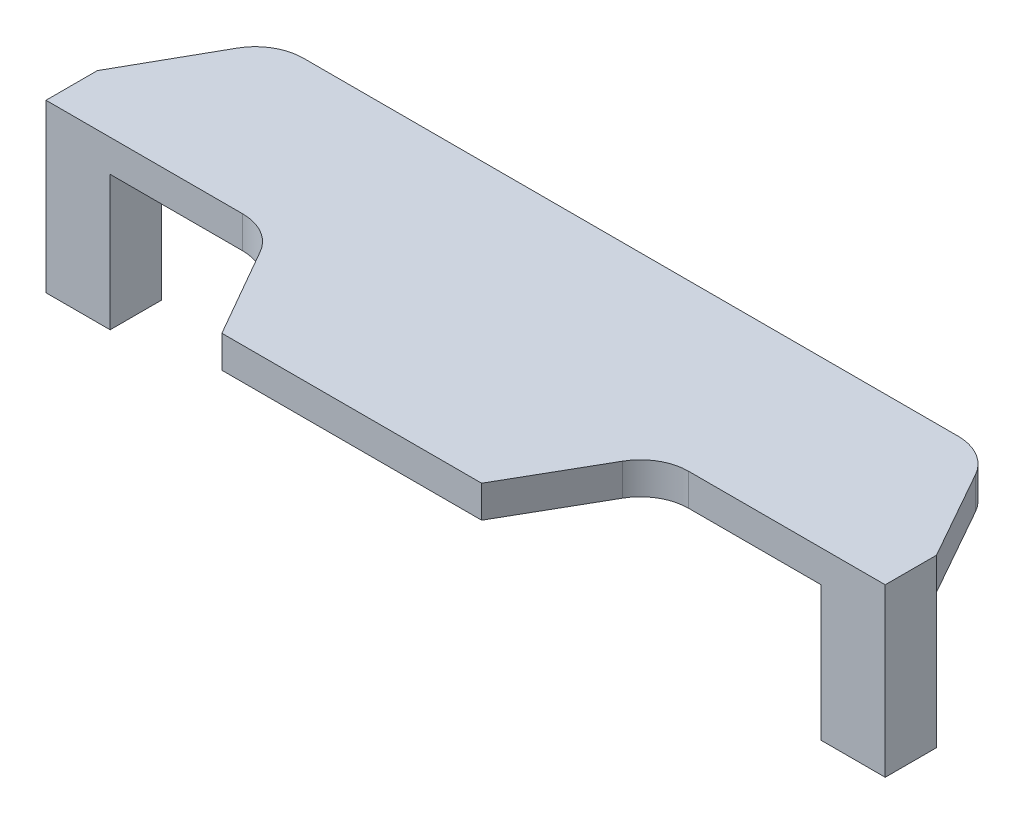
ISO-10303-21;
HEADER;
FILE_DESCRIPTION(('STEP AP214'),'2;1');
FILE_NAME('part.step','',(''),(''),'','','');
FILE_SCHEMA(('AUTOMOTIVE_DESIGN { 1 0 10303 214 1 1 1 1 }'));
ENDSEC;
DATA;
#1=APPLICATION_CONTEXT('core data for automotive mechanical design processes');
#2=APPLICATION_PROTOCOL_DEFINITION('international standard','automotive_design',2000,#1);
#3=PRODUCT_CONTEXT('',#1,'mechanical');
#4=PRODUCT('Part','Part','',(#3));
#5=PRODUCT_RELATED_PRODUCT_CATEGORY('part','',(#4));
#6=PRODUCT_DEFINITION_FORMATION('','',#4);
#7=PRODUCT_DEFINITION_CONTEXT('part definition',#1,'design');
#8=PRODUCT_DEFINITION('design','',#6,#7);
#9=PRODUCT_DEFINITION_SHAPE('','',#8);
#10=(LENGTH_UNIT() NAMED_UNIT(*) SI_UNIT(.MILLI.,.METRE.));
#11=(NAMED_UNIT(*) PLANE_ANGLE_UNIT() SI_UNIT($,.RADIAN.));
#12=(NAMED_UNIT(*) SI_UNIT($,.STERADIAN.) SOLID_ANGLE_UNIT());
#13=UNCERTAINTY_MEASURE_WITH_UNIT(LENGTH_MEASURE(1.E-05),#10,'distance_accuracy_value','');
#14=(GEOMETRIC_REPRESENTATION_CONTEXT(3) GLOBAL_UNCERTAINTY_ASSIGNED_CONTEXT((#13)) GLOBAL_UNIT_ASSIGNED_CONTEXT((#10,
#11,#12)) REPRESENTATION_CONTEXT('',''));
#15=CARTESIAN_POINT('',(0.,0.,0.));
#16=DIRECTION('',(0.,0.,1.));
#17=DIRECTION('',(1.,0.,0.));
#18=AXIS2_PLACEMENT_3D('',#15,#16,#17);
#19=CARTESIAN_POINT('',(51.042007296389,21.,-14.25));
#20=DIRECTION('',(0.,-1.,0.));
#21=DIRECTION('',(0.,0.,-1.));
#22=AXIS2_PLACEMENT_3D('',#19,#20,#21);
#23=PLANE('',#22);
#24=DIRECTION('',(-0.490843733940777,0.,-0.871247627744877));
#25=VECTOR('',#24,1.);
#26=CARTESIAN_POINT('',(65.425,21.,-4.));
#27=LINE('',#26,#25);
#28=CARTESIAN_POINT('',(65.425,21.,-4.));
#29=VERTEX_POINT('',#28);
#30=CARTESIAN_POINT('',(57.5763645044756,21.,-17.9313280045558));
#31=VERTEX_POINT('',#30);
#32=EDGE_CURVE('E151',#29,#31,#27,.T.);
#33=ORIENTED_EDGE('',*,*,#32,.F.);
#34=DIRECTION('',(-1.,0.,0.));
#35=VECTOR('',#34,1.);
#36=CARTESIAN_POINT('',(65.425,21.,-4.));
#37=LINE('',#36,#35);
#38=CARTESIAN_POINT('',(55.425,21.,-4.));
#39=VERTEX_POINT('',#38);
#40=EDGE_CURVE('E321',#29,#39,#37,.T.);
#41=ORIENTED_EDGE('',*,*,#40,.T.);
#42=DIRECTION('',(0.,0.,1.));
#43=VECTOR('',#42,1.);
#44=CARTESIAN_POINT('',(55.425,21.,4.));
#45=LINE('',#44,#43);
#46=CARTESIAN_POINT('',(55.425,21.,4.));
#47=VERTEX_POINT('',#46);
#48=EDGE_CURVE('E329',#39,#47,#45,.T.);
#49=ORIENTED_EDGE('',*,*,#48,.T.);
#50=DIRECTION('',(1.,0.,0.));
#51=VECTOR('',#50,1.);
#52=CARTESIAN_POINT('',(65.425,21.,4.));
#53=LINE('',#52,#51);
#54=CARTESIAN_POINT('',(34.7705838750584,21.,4.));
#55=VERTEX_POINT('',#54);
#56=EDGE_CURVE('E148',#55,#47,#53,.T.);
#57=ORIENTED_EDGE('',*,*,#56,.F.);
#58=CARTESIAN_POINT('',(34.7705838750584,21.,11.5));
#59=DIRECTION('',(0.,-1.,0.));
#60=DIRECTION('',(0.,0.,-1.));
#61=AXIS2_PLACEMENT_3D('',#58,#59,#60);
#62=CIRCLE('',#61,7.5);
#63=CARTESIAN_POINT('',(28.2638420487668,21.,7.77007898126669));
#64=VERTEX_POINT('',#63);
#65=EDGE_CURVE('E145',#64,#55,#62,.T.);
#66=ORIENTED_EDGE('',*,*,#65,.F.);
#67=DIRECTION('',(0.497322802497774,0.,-0.867565576838869));
#68=VECTOR('',#67,1.);
#69=CARTESIAN_POINT('',(28.2638420487668,21.,7.77007898126669));
#70=LINE('',#69,#68);
#71=CARTESIAN_POINT('',(20.25,21.,21.75));
#72=VERTEX_POINT('',#71);
#73=EDGE_CURVE('E142',#72,#64,#70,.T.);
#74=ORIENTED_EDGE('',*,*,#73,.F.);
#75=DIRECTION('',(1.,0.,0.));
#76=VECTOR('',#75,1.);
#77=CARTESIAN_POINT('',(-20.25,21.,21.75));
#78=LINE('',#77,#76);
#79=CARTESIAN_POINT('',(-20.25,21.,21.75));
#80=VERTEX_POINT('',#79);
#81=EDGE_CURVE('E139',#80,#72,#78,.T.);
#82=ORIENTED_EDGE('',*,*,#81,.F.);
#83=DIRECTION('',(0.497322802497775,0.,0.867565576838869));
#84=VECTOR('',#83,1.);
#85=CARTESIAN_POINT('',(-28.2638420487668,21.,7.77007898126669));
#86=LINE('',#85,#84);
#87=CARTESIAN_POINT('',(-28.2638420487668,21.,7.77007898126669));
#88=VERTEX_POINT('',#87);
#89=EDGE_CURVE('E136',#88,#80,#86,.T.);
#90=ORIENTED_EDGE('',*,*,#89,.F.);
#91=CARTESIAN_POINT('',(-34.7705838750584,21.,11.5));
#92=DIRECTION('',(0.,-1.,0.));
#93=DIRECTION('',(0.,0.,1.));
#94=AXIS2_PLACEMENT_3D('',#91,#92,#93);
#95=CIRCLE('',#94,7.5);
#96=CARTESIAN_POINT('',(-34.7705838750584,21.,4.));
#97=VERTEX_POINT('',#96);
#98=EDGE_CURVE('E127',#97,#88,#95,.T.);
#99=ORIENTED_EDGE('',*,*,#98,.F.);
#100=DIRECTION('',(1.,0.,0.));
#101=VECTOR('',#100,1.);
#102=CARTESIAN_POINT('',(-65.425,21.,4.));
#103=LINE('',#102,#101);
#104=CARTESIAN_POINT('',(-55.425,21.,4.));
#105=VERTEX_POINT('',#104);
#106=EDGE_CURVE('E124',#105,#97,#103,.T.);
#107=ORIENTED_EDGE('',*,*,#106,.F.);
#108=DIRECTION('',(0.,0.,-1.));
#109=VECTOR('',#108,1.);
#110=CARTESIAN_POINT('',(-55.425,21.,4.));
#111=LINE('',#110,#109);
#112=CARTESIAN_POINT('',(-55.425,21.,-4.));
#113=VERTEX_POINT('',#112);
#114=EDGE_CURVE('E77',#105,#113,#111,.T.);
#115=ORIENTED_EDGE('',*,*,#114,.T.);
#116=DIRECTION('',(-1.,0.,0.));
#117=VECTOR('',#116,1.);
#118=CARTESIAN_POINT('',(-65.425,21.,-4.));
#119=LINE('',#118,#117);
#120=CARTESIAN_POINT('',(-65.425,21.,-4.));
#121=VERTEX_POINT('',#120);
#122=EDGE_CURVE('E85',#113,#121,#119,.T.);
#123=ORIENTED_EDGE('',*,*,#122,.T.);
#124=DIRECTION('',(-0.490843733940777,0.,0.871247627744877));
#125=VECTOR('',#124,1.);
#126=CARTESIAN_POINT('',(-65.425,21.,-4.));
#127=LINE('',#126,#125);
#128=CARTESIAN_POINT('',(-57.5763645044756,21.,-17.9313280045558));
#129=VERTEX_POINT('',#128);
#130=EDGE_CURVE('E117',#129,#121,#127,.T.);
#131=ORIENTED_EDGE('',*,*,#130,.F.);
#132=CARTESIAN_POINT('',(-51.042007296389,21.,-14.25));
#133=DIRECTION('',(0.,1.,0.));
#134=DIRECTION('',(0.,0.,1.));
#135=AXIS2_PLACEMENT_3D('',#132,#133,#134);
#136=CIRCLE('',#135,7.5);
#137=CARTESIAN_POINT('',(-51.042007296389,21.,-21.75));
#138=VERTEX_POINT('',#137);
#139=EDGE_CURVE('E125',#138,#129,#136,.T.);
#140=ORIENTED_EDGE('',*,*,#139,.F.);
#141=DIRECTION('',(-1.,0.,0.));
#142=VECTOR('',#141,1.);
#143=CARTESIAN_POINT('',(-21.75,21.,-21.75));
#144=LINE('',#143,#142);
#145=CARTESIAN_POINT('',(51.042007296389,21.,-21.75));
#146=VERTEX_POINT('',#145);
#147=EDGE_CURVE('E157',#146,#138,#144,.T.);
#148=ORIENTED_EDGE('',*,*,#147,.F.);
#149=CARTESIAN_POINT('',(51.042007296389,21.,-14.25));
#150=DIRECTION('',(0.,1.,0.));
#151=DIRECTION('',(0.,0.,-1.));
#152=AXIS2_PLACEMENT_3D('',#149,#150,#151);
#153=CIRCLE('',#152,7.5);
#154=EDGE_CURVE('E154',#31,#146,#153,.T.);
#155=ORIENTED_EDGE('',*,*,#154,.F.);
#156=EDGE_LOOP('',(#33,#41,#49,#57,#66,#74,#82,#90,#99,#107,#115,#123,#131,#140,#148,#155));
#157=FACE_BOUND('',#156,.T.);
#158=ADVANCED_FACE('F33',(#157),#23,.T.);
#159=CARTESIAN_POINT('',(-55.425,21.,4.));
#160=DIRECTION('',(-1.,0.,0.));
#161=DIRECTION('',(0.,0.,1.));
#162=AXIS2_PLACEMENT_3D('',#159,#160,#161);
#163=PLANE('',#162);
#164=DIRECTION('',(0.,0.,-1.));
#165=VECTOR('',#164,1.);
#166=CARTESIAN_POINT('',(-55.425,0.,4.));
#167=LINE('',#166,#165);
#168=CARTESIAN_POINT('',(-55.425,0.,4.));
#169=VERTEX_POINT('',#168);
#170=CARTESIAN_POINT('',(-55.425,0.,-4.));
#171=VERTEX_POINT('',#170);
#172=EDGE_CURVE('E82',#169,#171,#167,.T.);
#173=ORIENTED_EDGE('',*,*,#172,.T.);
#174=DIRECTION('',(0.,-1.,0.));
#175=VECTOR('',#174,1.);
#176=CARTESIAN_POINT('',(-55.425,21.,-4.));
#177=LINE('',#176,#175);
#178=EDGE_CURVE('E11',#113,#171,#177,.T.);
#179=ORIENTED_EDGE('',*,*,#178,.F.);
#180=ORIENTED_EDGE('',*,*,#114,.F.);
#181=DIRECTION('',(0.,-1.,0.));
#182=VECTOR('',#181,1.);
#183=CARTESIAN_POINT('',(-55.425,21.,4.));
#184=LINE('',#183,#182);
#185=EDGE_CURVE('E50',#105,#169,#184,.T.);
#186=ORIENTED_EDGE('',*,*,#185,.T.);
#187=EDGE_LOOP('',(#173,#179,#180,#186));
#188=FACE_BOUND('',#187,.T.);
#189=ADVANCED_FACE('F35',(#188),#163,.F.);
#190=CARTESIAN_POINT('',(-65.425,21.,-4.));
#191=DIRECTION('',(0.,0.,1.));
#192=DIRECTION('',(1.,0.,0.));
#193=AXIS2_PLACEMENT_3D('',#190,#191,#192);
#194=PLANE('',#193);
#195=DIRECTION('',(-1.,0.,0.));
#196=VECTOR('',#195,1.);
#197=CARTESIAN_POINT('',(-65.425,0.,-4.));
#198=LINE('',#197,#196);
#199=CARTESIAN_POINT('',(-65.425,0.,-4.));
#200=VERTEX_POINT('',#199);
#201=EDGE_CURVE('E88',#171,#200,#198,.T.);
#202=ORIENTED_EDGE('',*,*,#201,.T.);
#203=DIRECTION('',(0.,-1.,0.));
#204=VECTOR('',#203,1.);
#205=CARTESIAN_POINT('',(-65.425,21.,-4.));
#206=LINE('',#205,#204);
#207=EDGE_CURVE('E42',#121,#200,#206,.T.);
#208=ORIENTED_EDGE('',*,*,#207,.F.);
#209=ORIENTED_EDGE('',*,*,#122,.F.);
#210=ORIENTED_EDGE('',*,*,#178,.T.);
#211=EDGE_LOOP('',(#202,#208,#209,#210));
#212=FACE_BOUND('',#211,.T.);
#213=ADVANCED_FACE('F108',(#212),#194,.F.);
#214=CARTESIAN_POINT('',(-65.425,21.,4.));
#215=DIRECTION('',(1.,0.,0.));
#216=DIRECTION('',(0.,0.,-1.));
#217=AXIS2_PLACEMENT_3D('',#214,#215,#216);
#218=PLANE('',#217);
#219=DIRECTION('',(0.,0.,1.));
#220=VECTOR('',#219,1.);
#221=CARTESIAN_POINT('',(-65.425,0.,4.));
#222=LINE('',#221,#220);
#223=CARTESIAN_POINT('',(-65.425,0.,4.));
#224=VERTEX_POINT('',#223);
#225=EDGE_CURVE('E68',#200,#224,#222,.T.);
#226=ORIENTED_EDGE('',*,*,#225,.T.);
#227=DIRECTION('',(0.,-1.,0.));
#228=VECTOR('',#227,1.);
#229=CARTESIAN_POINT('',(-65.425,21.,4.));
#230=LINE('',#229,#228);
#231=CARTESIAN_POINT('',(-65.425,26.,4.));
#232=VERTEX_POINT('',#231);
#233=EDGE_CURVE('E74',#232,#224,#230,.T.);
#234=ORIENTED_EDGE('',*,*,#233,.F.);
#235=DIRECTION('',(0.,0.,1.));
#236=VECTOR('',#235,1.);
#237=CARTESIAN_POINT('',(-65.425,26.,-4.));
#238=LINE('',#237,#236);
#239=CARTESIAN_POINT('',(-65.425,26.,-4.));
#240=VERTEX_POINT('',#239);
#241=EDGE_CURVE('E397',#240,#232,#238,.T.);
#242=ORIENTED_EDGE('',*,*,#241,.F.);
#243=DIRECTION('',(0.,-1.,0.));
#244=VECTOR('',#243,1.);
#245=CARTESIAN_POINT('',(-65.425,26.,-4.));
#246=LINE('',#245,#244);
#247=EDGE_CURVE('E105',#240,#121,#246,.T.);
#248=ORIENTED_EDGE('',*,*,#247,.T.);
#249=ORIENTED_EDGE('',*,*,#207,.T.);
#250=EDGE_LOOP('',(#226,#234,#242,#248,#249));
#251=FACE_BOUND('',#250,.T.);
#252=ADVANCED_FACE('F101',(#251),#218,.F.);
#253=CARTESIAN_POINT('',(-65.425,21.,4.));
#254=DIRECTION('',(0.,0.,-1.));
#255=DIRECTION('',(-1.,0.,0.));
#256=AXIS2_PLACEMENT_3D('',#253,#254,#255);
#257=PLANE('',#256);
#258=DIRECTION('',(1.,0.,0.));
#259=VECTOR('',#258,1.);
#260=CARTESIAN_POINT('',(-65.425,0.,4.));
#261=LINE('',#260,#259);
#262=EDGE_CURVE('E71',#224,#169,#261,.T.);
#263=ORIENTED_EDGE('',*,*,#262,.T.);
#264=ORIENTED_EDGE('',*,*,#185,.F.);
#265=ORIENTED_EDGE('',*,*,#106,.T.);
#266=DIRECTION('',(0.,-1.,0.));
#267=VECTOR('',#266,1.);
#268=CARTESIAN_POINT('',(-34.7705838750584,26.,4.));
#269=LINE('',#268,#267);
#270=CARTESIAN_POINT('',(-34.7705838750584,26.,4.));
#271=VERTEX_POINT('',#270);
#272=EDGE_CURVE('E189',#271,#97,#269,.T.);
#273=ORIENTED_EDGE('',*,*,#272,.F.);
#274=DIRECTION('',(1.,0.,0.));
#275=VECTOR('',#274,1.);
#276=CARTESIAN_POINT('',(-65.425,26.,4.));
#277=LINE('',#276,#275);
#278=EDGE_CURVE('E400',#232,#271,#277,.T.);
#279=ORIENTED_EDGE('',*,*,#278,.F.);
#280=ORIENTED_EDGE('',*,*,#233,.T.);
#281=EDGE_LOOP('',(#263,#264,#265,#273,#279,#280));
#282=FACE_BOUND('',#281,.T.);
#283=ADVANCED_FACE('F72',(#282),#257,.F.);
#284=CARTESIAN_POINT('',(0.,0.,0.));
#285=DIRECTION('',(0.,-1.,0.));
#286=DIRECTION('',(0.,0.,-1.));
#287=AXIS2_PLACEMENT_3D('',#284,#285,#286);
#288=PLANE('',#287);
#289=ORIENTED_EDGE('',*,*,#172,.F.);
#290=ORIENTED_EDGE('',*,*,#262,.F.);
#291=ORIENTED_EDGE('',*,*,#225,.F.);
#292=ORIENTED_EDGE('',*,*,#201,.F.);
#293=EDGE_LOOP('',(#289,#290,#291,#292));
#294=FACE_BOUND('',#293,.T.);
#295=ADVANCED_FACE('F87',(#294),#288,.T.);
#296=CARTESIAN_POINT('',(-51.042007296389,26.,-14.25));
#297=DIRECTION('',(0.,-1.,0.));
#298=DIRECTION('',(0.,0.,-1.));
#299=AXIS2_PLACEMENT_3D('',#296,#297,#298);
#300=CYLINDRICAL_SURFACE('',#299,7.5);
#301=ORIENTED_EDGE('',*,*,#139,.T.);
#302=DIRECTION('',(0.,-1.,0.));
#303=VECTOR('',#302,1.);
#304=CARTESIAN_POINT('',(-57.5763645044756,26.,-17.9313280045558));
#305=LINE('',#304,#303);
#306=CARTESIAN_POINT('',(-57.5763645044756,26.,-17.9313280045558));
#307=VERTEX_POINT('',#306);
#308=EDGE_CURVE('E93',#307,#129,#305,.T.);
#309=ORIENTED_EDGE('',*,*,#308,.F.);
#310=CARTESIAN_POINT('',(-51.042007296389,26.,-14.25));
#311=DIRECTION('',(0.,1.,0.));
#312=DIRECTION('',(0.,0.,1.));
#313=AXIS2_PLACEMENT_3D('',#310,#311,#312);
#314=CIRCLE('',#313,7.5);
#315=CARTESIAN_POINT('',(-51.042007296389,26.,-21.75));
#316=VERTEX_POINT('',#315);
#317=EDGE_CURVE('E393',#316,#307,#314,.T.);
#318=ORIENTED_EDGE('',*,*,#317,.F.);
#319=DIRECTION('',(0.,-1.,0.));
#320=VECTOR('',#319,1.);
#321=CARTESIAN_POINT('',(-51.042007296389,26.,-21.75));
#322=LINE('',#321,#320);
#323=EDGE_CURVE('E89',#316,#138,#322,.T.);
#324=ORIENTED_EDGE('',*,*,#323,.T.);
#325=EDGE_LOOP('',(#301,#309,#318,#324));
#326=FACE_BOUND('',#325,.T.);
#327=ADVANCED_FACE('F402',(#326),#300,.T.);
#328=CARTESIAN_POINT('',(-65.425,26.,-4.));
#329=DIRECTION('',(0.871247627744877,0.,0.490843733940777));
#330=DIRECTION('',(0.490843733940777,0.,-0.871247627744877));
#331=AXIS2_PLACEMENT_3D('',#328,#329,#330);
#332=PLANE('',#331);
#333=ORIENTED_EDGE('',*,*,#130,.T.);
#334=ORIENTED_EDGE('',*,*,#247,.F.);
#335=DIRECTION('',(-0.490843733940777,0.,0.871247627744877));
#336=VECTOR('',#335,1.);
#337=CARTESIAN_POINT('',(-65.425,26.,-4.));
#338=LINE('',#337,#336);
#339=EDGE_CURVE('E395',#307,#240,#338,.T.);
#340=ORIENTED_EDGE('',*,*,#339,.F.);
#341=ORIENTED_EDGE('',*,*,#308,.T.);
#342=EDGE_LOOP('',(#333,#334,#340,#341));
#343=FACE_BOUND('',#342,.T.);
#344=ADVANCED_FACE('F120',(#343),#332,.F.);
#345=CARTESIAN_POINT('',(-34.7705838750584,26.,11.5));
#346=DIRECTION('',(0.,-1.,0.));
#347=DIRECTION('',(0.,0.,-1.));
#348=AXIS2_PLACEMENT_3D('',#345,#346,#347);
#349=CYLINDRICAL_SURFACE('',#348,7.5);
#350=ORIENTED_EDGE('',*,*,#98,.T.);
#351=DIRECTION('',(0.,-1.,0.));
#352=VECTOR('',#351,1.);
#353=CARTESIAN_POINT('',(-28.2638420487668,26.,7.77007898126669));
#354=LINE('',#353,#352);
#355=CARTESIAN_POINT('',(-28.2638420487668,26.,7.77007898126669));
#356=VERTEX_POINT('',#355);
#357=EDGE_CURVE('E186',#356,#88,#354,.T.);
#358=ORIENTED_EDGE('',*,*,#357,.F.);
#359=CARTESIAN_POINT('',(-34.7705838750584,26.,11.5));
#360=DIRECTION('',(0.,-1.,0.));
#361=DIRECTION('',(0.,0.,1.));
#362=AXIS2_PLACEMENT_3D('',#359,#360,#361);
#363=CIRCLE('',#362,7.5);
#364=EDGE_CURVE('E202',#271,#356,#363,.T.);
#365=ORIENTED_EDGE('',*,*,#364,.F.);
#366=ORIENTED_EDGE('',*,*,#272,.T.);
#367=EDGE_LOOP('',(#350,#358,#365,#366));
#368=FACE_BOUND('',#367,.T.);
#369=ADVANCED_FACE('F197',(#368),#349,.F.);
#370=CARTESIAN_POINT('',(-28.2638420487668,26.,7.77007898126669));
#371=DIRECTION('',(0.867565576838869,0.,-0.497322802497775));
#372=DIRECTION('',(-0.497322802497775,0.,-0.867565576838869));
#373=AXIS2_PLACEMENT_3D('',#370,#371,#372);
#374=PLANE('',#373);
#375=ORIENTED_EDGE('',*,*,#89,.T.);
#376=DIRECTION('',(0.,-1.,0.));
#377=VECTOR('',#376,1.);
#378=CARTESIAN_POINT('',(-20.25,26.,21.75));
#379=LINE('',#378,#377);
#380=CARTESIAN_POINT('',(-20.25,26.,21.75));
#381=VERTEX_POINT('',#380);
#382=EDGE_CURVE('E183',#381,#80,#379,.T.);
#383=ORIENTED_EDGE('',*,*,#382,.F.);
#384=DIRECTION('',(0.497322802497775,0.,0.867565576838869));
#385=VECTOR('',#384,1.);
#386=CARTESIAN_POINT('',(-28.2638420487668,26.,7.77007898126669));
#387=LINE('',#386,#385);
#388=EDGE_CURVE('E230',#356,#381,#387,.T.);
#389=ORIENTED_EDGE('',*,*,#388,.F.);
#390=ORIENTED_EDGE('',*,*,#357,.T.);
#391=EDGE_LOOP('',(#375,#383,#389,#390));
#392=FACE_BOUND('',#391,.T.);
#393=ADVANCED_FACE('F211',(#392),#374,.F.);
#394=CARTESIAN_POINT('',(-20.25,26.,21.75));
#395=DIRECTION('',(0.,0.,-1.));
#396=DIRECTION('',(-1.,0.,0.));
#397=AXIS2_PLACEMENT_3D('',#394,#395,#396);
#398=PLANE('',#397);
#399=ORIENTED_EDGE('',*,*,#81,.T.);
#400=DIRECTION('',(0.,-1.,0.));
#401=VECTOR('',#400,1.);
#402=CARTESIAN_POINT('',(20.25,26.,21.75));
#403=LINE('',#402,#401);
#404=CARTESIAN_POINT('',(20.25,26.,21.75));
#405=VERTEX_POINT('',#404);
#406=EDGE_CURVE('E180',#405,#72,#403,.T.);
#407=ORIENTED_EDGE('',*,*,#406,.F.);
#408=DIRECTION('',(1.,0.,0.));
#409=VECTOR('',#408,1.);
#410=CARTESIAN_POINT('',(-20.25,26.,21.75));
#411=LINE('',#410,#409);
#412=EDGE_CURVE('E221',#381,#405,#411,.T.);
#413=ORIENTED_EDGE('',*,*,#412,.F.);
#414=ORIENTED_EDGE('',*,*,#382,.T.);
#415=EDGE_LOOP('',(#399,#407,#413,#414));
#416=FACE_BOUND('',#415,.T.);
#417=ADVANCED_FACE('F218',(#416),#398,.F.);
#418=CARTESIAN_POINT('',(28.2638420487668,26.,7.77007898126669));
#419=DIRECTION('',(-0.867565576838869,0.,-0.497322802497774));
#420=DIRECTION('',(-0.497322802497774,0.,0.867565576838869));
#421=AXIS2_PLACEMENT_3D('',#418,#419,#420);
#422=PLANE('',#421);
#423=ORIENTED_EDGE('',*,*,#73,.T.);
#424=DIRECTION('',(0.,-1.,0.));
#425=VECTOR('',#424,1.);
#426=CARTESIAN_POINT('',(28.2638420487668,26.,7.77007898126669));
#427=LINE('',#426,#425);
#428=CARTESIAN_POINT('',(28.2638420487668,26.,7.77007898126669));
#429=VERTEX_POINT('',#428);
#430=EDGE_CURVE('E177',#429,#64,#427,.T.);
#431=ORIENTED_EDGE('',*,*,#430,.F.);
#432=DIRECTION('',(0.497322802497774,0.,-0.867565576838869));
#433=VECTOR('',#432,1.);
#434=CARTESIAN_POINT('',(28.2638420487668,26.,7.77007898126669));
#435=LINE('',#434,#433);
#436=EDGE_CURVE('E229',#405,#429,#435,.T.);
#437=ORIENTED_EDGE('',*,*,#436,.F.);
#438=ORIENTED_EDGE('',*,*,#406,.T.);
#439=EDGE_LOOP('',(#423,#431,#437,#438));
#440=FACE_BOUND('',#439,.T.);
#441=ADVANCED_FACE('F487',(#440),#422,.F.);
#442=CARTESIAN_POINT('',(34.7705838750584,26.,11.5));
#443=DIRECTION('',(0.,-1.,0.));
#444=DIRECTION('',(0.,0.,-1.));
#445=AXIS2_PLACEMENT_3D('',#442,#443,#444);
#446=CYLINDRICAL_SURFACE('',#445,7.5);
#447=ORIENTED_EDGE('',*,*,#65,.T.);
#448=DIRECTION('',(0.,-1.,0.));
#449=VECTOR('',#448,1.);
#450=CARTESIAN_POINT('',(34.7705838750584,26.,4.));
#451=LINE('',#450,#449);
#452=CARTESIAN_POINT('',(34.7705838750584,26.,4.));
#453=VERTEX_POINT('',#452);
#454=EDGE_CURVE('E174',#453,#55,#451,.T.);
#455=ORIENTED_EDGE('',*,*,#454,.F.);
#456=CARTESIAN_POINT('',(34.7705838750584,26.,11.5));
#457=DIRECTION('',(0.,-1.,0.));
#458=DIRECTION('',(0.,0.,-1.));
#459=AXIS2_PLACEMENT_3D('',#456,#457,#458);
#460=CIRCLE('',#459,7.5);
#461=EDGE_CURVE('E232',#429,#453,#460,.T.);
#462=ORIENTED_EDGE('',*,*,#461,.F.);
#463=ORIENTED_EDGE('',*,*,#430,.T.);
#464=EDGE_LOOP('',(#447,#455,#462,#463));
#465=FACE_BOUND('',#464,.T.);
#466=ADVANCED_FACE('F495',(#465),#446,.F.);
#467=CARTESIAN_POINT('',(65.425,26.,4.));
#468=DIRECTION('',(0.,0.,-1.));
#469=DIRECTION('',(-1.,0.,0.));
#470=AXIS2_PLACEMENT_3D('',#467,#468,#469);
#471=PLANE('',#470);
#472=ORIENTED_EDGE('',*,*,#56,.T.);
#473=DIRECTION('',(0.,-1.,0.));
#474=VECTOR('',#473,1.);
#475=CARTESIAN_POINT('',(55.425,21.,4.));
#476=LINE('',#475,#474);
#477=CARTESIAN_POINT('',(55.425,0.,4.));
#478=VERTEX_POINT('',#477);
#479=EDGE_CURVE('E388',#47,#478,#476,.T.);
#480=ORIENTED_EDGE('',*,*,#479,.T.);
#481=DIRECTION('',(1.,0.,0.));
#482=VECTOR('',#481,1.);
#483=CARTESIAN_POINT('',(65.425,0.,4.));
#484=LINE('',#483,#482);
#485=CARTESIAN_POINT('',(65.425,0.,4.));
#486=VERTEX_POINT('',#485);
#487=EDGE_CURVE('E330',#478,#486,#484,.T.);
#488=ORIENTED_EDGE('',*,*,#487,.T.);
#489=DIRECTION('',(0.,-1.,0.));
#490=VECTOR('',#489,1.);
#491=CARTESIAN_POINT('',(65.425,26.,4.));
#492=LINE('',#491,#490);
#493=CARTESIAN_POINT('',(65.425,26.,4.));
#494=VERTEX_POINT('',#493);
#495=EDGE_CURVE('E171',#494,#486,#492,.T.);
#496=ORIENTED_EDGE('',*,*,#495,.F.);
#497=DIRECTION('',(1.,0.,0.));
#498=VECTOR('',#497,1.);
#499=CARTESIAN_POINT('',(65.425,26.,4.));
#500=LINE('',#499,#498);
#501=EDGE_CURVE('E239',#453,#494,#500,.T.);
#502=ORIENTED_EDGE('',*,*,#501,.F.);
#503=ORIENTED_EDGE('',*,*,#454,.T.);
#504=EDGE_LOOP('',(#472,#480,#488,#496,#502,#503));
#505=FACE_BOUND('',#504,.T.);
#506=ADVANCED_FACE('F348',(#505),#471,.F.);
#507=CARTESIAN_POINT('',(65.425,26.,-4.));
#508=DIRECTION('',(-1.,0.,0.));
#509=DIRECTION('',(0.,0.,1.));
#510=AXIS2_PLACEMENT_3D('',#507,#508,#509);
#511=PLANE('',#510);
#512=ORIENTED_EDGE('',*,*,#495,.T.);
#513=DIRECTION('',(0.,0.,-1.));
#514=VECTOR('',#513,1.);
#515=CARTESIAN_POINT('',(65.425,0.,4.));
#516=LINE('',#515,#514);
#517=CARTESIAN_POINT('',(65.425,0.,-4.));
#518=VERTEX_POINT('',#517);
#519=EDGE_CURVE('E337',#486,#518,#516,.T.);
#520=ORIENTED_EDGE('',*,*,#519,.T.);
#521=DIRECTION('',(0.,-1.,0.));
#522=VECTOR('',#521,1.);
#523=CARTESIAN_POINT('',(65.425,21.,-4.));
#524=LINE('',#523,#522);
#525=EDGE_CURVE('E130',#29,#518,#524,.T.);
#526=ORIENTED_EDGE('',*,*,#525,.F.);
#527=DIRECTION('',(0.,-1.,0.));
#528=VECTOR('',#527,1.);
#529=CARTESIAN_POINT('',(65.425,26.,-4.));
#530=LINE('',#529,#528);
#531=CARTESIAN_POINT('',(65.425,26.,-4.));
#532=VERTEX_POINT('',#531);
#533=EDGE_CURVE('E168',#532,#29,#530,.T.);
#534=ORIENTED_EDGE('',*,*,#533,.F.);
#535=DIRECTION('',(0.,0.,-1.));
#536=VECTOR('',#535,1.);
#537=CARTESIAN_POINT('',(65.425,26.,-4.));
#538=LINE('',#537,#536);
#539=EDGE_CURVE('E242',#494,#532,#538,.T.);
#540=ORIENTED_EDGE('',*,*,#539,.F.);
#541=EDGE_LOOP('',(#512,#520,#526,#534,#540));
#542=FACE_BOUND('',#541,.T.);
#543=ADVANCED_FACE('F334',(#542),#511,.F.);
#544=CARTESIAN_POINT('',(65.425,26.,-4.));
#545=DIRECTION('',(-0.871247627744877,0.,0.490843733940777));
#546=DIRECTION('',(0.490843733940777,0.,0.871247627744877));
#547=AXIS2_PLACEMENT_3D('',#544,#545,#546);
#548=PLANE('',#547);
#549=ORIENTED_EDGE('',*,*,#32,.T.);
#550=DIRECTION('',(0.,-1.,0.));
#551=VECTOR('',#550,1.);
#552=CARTESIAN_POINT('',(57.5763645044756,26.,-17.9313280045558));
#553=LINE('',#552,#551);
#554=CARTESIAN_POINT('',(57.5763645044756,26.,-17.9313280045558));
#555=VERTEX_POINT('',#554);
#556=EDGE_CURVE('E164',#555,#31,#553,.T.);
#557=ORIENTED_EDGE('',*,*,#556,.F.);
#558=DIRECTION('',(-0.490843733940777,0.,-0.871247627744877));
#559=VECTOR('',#558,1.);
#560=CARTESIAN_POINT('',(65.425,26.,-4.));
#561=LINE('',#560,#559);
#562=EDGE_CURVE('E245',#532,#555,#561,.T.);
#563=ORIENTED_EDGE('',*,*,#562,.F.);
#564=ORIENTED_EDGE('',*,*,#533,.T.);
#565=EDGE_LOOP('',(#549,#557,#563,#564));
#566=FACE_BOUND('',#565,.T.);
#567=ADVANCED_FACE('F340',(#566),#548,.F.);
#568=CARTESIAN_POINT('',(51.042007296389,26.,-14.25));
#569=DIRECTION('',(0.,-1.,0.));
#570=DIRECTION('',(0.,0.,-1.));
#571=AXIS2_PLACEMENT_3D('',#568,#569,#570);
#572=CYLINDRICAL_SURFACE('',#571,7.5);
#573=ORIENTED_EDGE('',*,*,#154,.T.);
#574=DIRECTION('',(0.,-1.,0.));
#575=VECTOR('',#574,1.);
#576=CARTESIAN_POINT('',(51.042007296389,26.,-21.75));
#577=LINE('',#576,#575);
#578=CARTESIAN_POINT('',(51.042007296389,26.,-21.75));
#579=VERTEX_POINT('',#578);
#580=EDGE_CURVE('E161',#579,#146,#577,.T.);
#581=ORIENTED_EDGE('',*,*,#580,.F.);
#582=CARTESIAN_POINT('',(51.042007296389,26.,-14.25));
#583=DIRECTION('',(0.,1.,0.));
#584=DIRECTION('',(0.,0.,-1.));
#585=AXIS2_PLACEMENT_3D('',#582,#583,#584);
#586=CIRCLE('',#585,7.5);
#587=EDGE_CURVE('E165',#555,#579,#586,.T.);
#588=ORIENTED_EDGE('',*,*,#587,.F.);
#589=ORIENTED_EDGE('',*,*,#556,.T.);
#590=EDGE_LOOP('',(#573,#581,#588,#589));
#591=FACE_BOUND('',#590,.T.);
#592=ADVANCED_FACE('F261',(#591),#572,.T.);
#593=CARTESIAN_POINT('',(-21.75,26.,-21.75));
#594=DIRECTION('',(0.,0.,1.));
#595=DIRECTION('',(1.,0.,0.));
#596=AXIS2_PLACEMENT_3D('',#593,#594,#595);
#597=PLANE('',#596);
#598=ORIENTED_EDGE('',*,*,#147,.T.);
#599=ORIENTED_EDGE('',*,*,#323,.F.);
#600=DIRECTION('',(-1.,0.,0.));
#601=VECTOR('',#600,1.);
#602=CARTESIAN_POINT('',(-51.042007296389,26.,-21.75));
#603=LINE('',#602,#601);
#604=EDGE_CURVE('E160',#579,#316,#603,.T.);
#605=ORIENTED_EDGE('',*,*,#604,.F.);
#606=ORIENTED_EDGE('',*,*,#580,.T.);
#607=EDGE_LOOP('',(#598,#599,#605,#606));
#608=FACE_BOUND('',#607,.T.);
#609=ADVANCED_FACE('F265',(#608),#597,.F.);
#610=CARTESIAN_POINT('',(51.042007296389,26.,-14.25));
#611=DIRECTION('',(0.,-1.,0.));
#612=DIRECTION('',(0.,0.,-1.));
#613=AXIS2_PLACEMENT_3D('',#610,#611,#612);
#614=PLANE('',#613);
#615=ORIENTED_EDGE('',*,*,#604,.T.);
#616=ORIENTED_EDGE('',*,*,#317,.T.);
#617=ORIENTED_EDGE('',*,*,#339,.T.);
#618=ORIENTED_EDGE('',*,*,#241,.T.);
#619=ORIENTED_EDGE('',*,*,#278,.T.);
#620=ORIENTED_EDGE('',*,*,#364,.T.);
#621=ORIENTED_EDGE('',*,*,#388,.T.);
#622=ORIENTED_EDGE('',*,*,#412,.T.);
#623=ORIENTED_EDGE('',*,*,#436,.T.);
#624=ORIENTED_EDGE('',*,*,#461,.T.);
#625=ORIENTED_EDGE('',*,*,#501,.T.);
#626=ORIENTED_EDGE('',*,*,#539,.T.);
#627=ORIENTED_EDGE('',*,*,#562,.T.);
#628=ORIENTED_EDGE('',*,*,#587,.T.);
#629=EDGE_LOOP('',(#615,#616,#617,#618,#619,#620,#621,#622,#623,#624,#625,#626,#627,#628));
#630=FACE_BOUND('',#629,.T.);
#631=ADVANCED_FACE('F251',(#630),#614,.F.);
#632=CARTESIAN_POINT('',(65.425,21.,-4.));
#633=DIRECTION('',(0.,0.,1.));
#634=DIRECTION('',(1.,0.,0.));
#635=AXIS2_PLACEMENT_3D('',#632,#633,#634);
#636=PLANE('',#635);
#637=DIRECTION('',(-1.,0.,0.));
#638=VECTOR('',#637,1.);
#639=CARTESIAN_POINT('',(65.425,0.,-4.));
#640=LINE('',#639,#638);
#641=CARTESIAN_POINT('',(55.425,0.,-4.));
#642=VERTEX_POINT('',#641);
#643=EDGE_CURVE('E380',#518,#642,#640,.T.);
#644=ORIENTED_EDGE('',*,*,#643,.T.);
#645=DIRECTION('',(0.,-1.,0.));
#646=VECTOR('',#645,1.);
#647=CARTESIAN_POINT('',(55.425,21.,-4.));
#648=LINE('',#647,#646);
#649=EDGE_CURVE('E326',#39,#642,#648,.T.);
#650=ORIENTED_EDGE('',*,*,#649,.F.);
#651=ORIENTED_EDGE('',*,*,#40,.F.);
#652=ORIENTED_EDGE('',*,*,#525,.T.);
#653=EDGE_LOOP('',(#644,#650,#651,#652));
#654=FACE_BOUND('',#653,.T.);
#655=ADVANCED_FACE('F323',(#654),#636,.F.);
#656=CARTESIAN_POINT('',(55.425,21.,4.));
#657=DIRECTION('',(1.,0.,0.));
#658=DIRECTION('',(0.,0.,-1.));
#659=AXIS2_PLACEMENT_3D('',#656,#657,#658);
#660=PLANE('',#659);
#661=DIRECTION('',(0.,0.,1.));
#662=VECTOR('',#661,1.);
#663=CARTESIAN_POINT('',(55.425,0.,4.));
#664=LINE('',#663,#662);
#665=EDGE_CURVE('E382',#642,#478,#664,.T.);
#666=ORIENTED_EDGE('',*,*,#665,.T.);
#667=ORIENTED_EDGE('',*,*,#479,.F.);
#668=ORIENTED_EDGE('',*,*,#48,.F.);
#669=ORIENTED_EDGE('',*,*,#649,.T.);
#670=EDGE_LOOP('',(#666,#667,#668,#669));
#671=FACE_BOUND('',#670,.T.);
#672=ADVANCED_FACE('F365',(#671),#660,.F.);
#673=CARTESIAN_POINT('',(0.,0.,0.));
#674=DIRECTION('',(0.,1.,0.));
#675=DIRECTION('',(0.,0.,1.));
#676=AXIS2_PLACEMENT_3D('',#673,#674,#675);
#677=PLANE('',#676);
#678=ORIENTED_EDGE('',*,*,#519,.F.);
#679=ORIENTED_EDGE('',*,*,#487,.F.);
#680=ORIENTED_EDGE('',*,*,#665,.F.);
#681=ORIENTED_EDGE('',*,*,#643,.F.);
#682=EDGE_LOOP('',(#678,#679,#680,#681));
#683=FACE_BOUND('',#682,.T.);
#684=ADVANCED_FACE('F369',(#683),#677,.F.);
#685=CLOSED_SHELL('',(#158,#189,#213,#252,#283,#295,#327,#344,#369,#393,#417,#441,#466,#506,
#543,#567,#592,#609,#631,#655,#672,#684));
#686=MANIFOLD_SOLID_BREP('B2',#685);
#687=ADVANCED_BREP_SHAPE_REPRESENTATION('',(#18,#686),#14);
#688=SHAPE_DEFINITION_REPRESENTATION(#9,#687);
ENDSEC;
END-ISO-10303-21;
